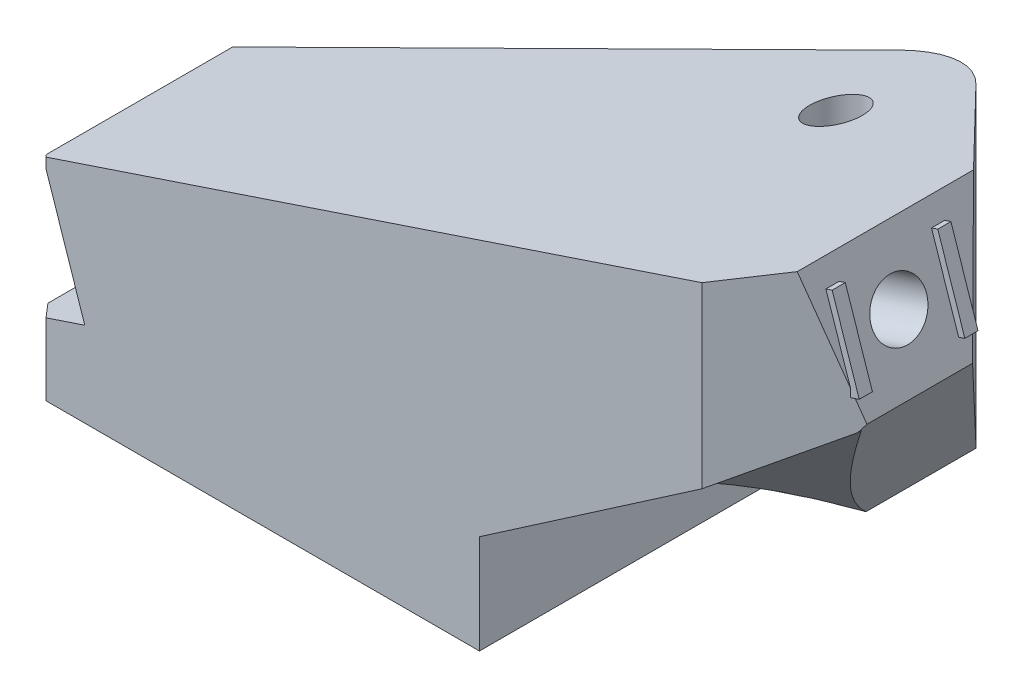
ISO-10303-21;
HEADER;
FILE_DESCRIPTION(('STEP AP214'),'2;1');
FILE_NAME('part.step','',(''),(''),'','','');
FILE_SCHEMA(('AUTOMOTIVE_DESIGN { 1 0 10303 214 1 1 1 1 }'));
ENDSEC;
DATA;
#1=APPLICATION_CONTEXT('core data for automotive mechanical design processes');
#2=APPLICATION_PROTOCOL_DEFINITION('international standard','automotive_design',2000,#1);
#3=PRODUCT_CONTEXT('',#1,'mechanical');
#4=PRODUCT('Part','Part','',(#3));
#5=PRODUCT_RELATED_PRODUCT_CATEGORY('part','',(#4));
#6=PRODUCT_DEFINITION_FORMATION('','',#4);
#7=PRODUCT_DEFINITION_CONTEXT('part definition',#1,'design');
#8=PRODUCT_DEFINITION('design','',#6,#7);
#9=PRODUCT_DEFINITION_SHAPE('','',#8);
#10=(LENGTH_UNIT() NAMED_UNIT(*) SI_UNIT(.MILLI.,.METRE.));
#11=(NAMED_UNIT(*) PLANE_ANGLE_UNIT() SI_UNIT($,.RADIAN.));
#12=(NAMED_UNIT(*) SI_UNIT($,.STERADIAN.) SOLID_ANGLE_UNIT());
#13=UNCERTAINTY_MEASURE_WITH_UNIT(LENGTH_MEASURE(1.E-05),#10,'distance_accuracy_value','');
#14=(GEOMETRIC_REPRESENTATION_CONTEXT(3) GLOBAL_UNCERTAINTY_ASSIGNED_CONTEXT((#13)) GLOBAL_UNIT_ASSIGNED_CONTEXT((#10,
#11,#12)) REPRESENTATION_CONTEXT('',''));
#15=CARTESIAN_POINT('',(0.,0.,0.));
#16=DIRECTION('',(0.,0.,1.));
#17=DIRECTION('',(1.,0.,0.));
#18=AXIS2_PLACEMENT_3D('',#15,#16,#17);
#19=CARTESIAN_POINT('',(-154.33875422493,28.9689270881601,-70.));
#20=DIRECTION('',(-0.316937711246489,0.948446354408006,0.));
#21=DIRECTION('',(-0.948446354408006,-0.316937711246489,0.));
#22=AXIS2_PLACEMENT_3D('',#19,#20,#21);
#23=PLANE('',#22);
#24=CARTESIAN_POINT('',(-64.6761161480805,58.9310553248555,-21.));
#25=DIRECTION('',(-0.316937711246489,0.948446354408006,0.));
#26=DIRECTION('',(-0.948446354408006,-0.316937711246489,0.));
#27=AXIS2_PLACEMENT_3D('',#24,#25,#26);
#28=ELLIPSE('',#27,4.21742355949767,4.00000000000001);
#29=CARTESIAN_POINT('',(-68.6761161480805,57.5943947545513,-21.));
#30=VERTEX_POINT('',#29);
#31=EDGE_CURVE('E276',#30,#30,#28,.T.);
#32=ORIENTED_EDGE('',*,*,#31,.F.);
#33=EDGE_LOOP('',(#32));
#34=FACE_BOUND('',#33,.T.);
#35=DIRECTION('',(0.907406140885003,0.303223502443224,-0.290980416953185));
#36=VECTOR('',#35,1.);
#37=CARTESIAN_POINT('',(-137.968434357253,34.439317360758,-13.2495153891155));
#38=LINE('',#37,#36);
#39=CARTESIAN_POINT('',(-145.802737035258,31.8213664893785,-10.7372680534737));
#40=VERTEX_POINT('',#39);
#41=CARTESIAN_POINT('',(-69.2564678070727,57.4004614596799,-35.2835702357627));
#42=VERTEX_POINT('',#41);
#43=EDGE_CURVE('E305',#40,#42,#38,.T.);
#44=ORIENTED_EDGE('',*,*,#43,.F.);
#45=DIRECTION('',(0.,0.,1.));
#46=VECTOR('',#45,1.);
#47=CARTESIAN_POINT('',(-145.802737035258,31.8213664893785,-70.));
#48=LINE('',#47,#46);
#49=CARTESIAN_POINT('',(-145.802737035258,31.8213664893785,17.48446354408));
#50=VERTEX_POINT('',#49);
#51=EDGE_CURVE('E62',#40,#50,#48,.T.);
#52=ORIENTED_EDGE('',*,*,#51,.T.);
#53=DIRECTION('',(-0.652851363434484,-0.218160168943055,-0.725390403816092));
#54=VECTOR('',#53,1.);
#55=CARTESIAN_POINT('',(-191.277379128913,16.6253262305573,-33.042916559981));
#56=LINE('',#55,#54);
#57=CARTESIAN_POINT('',(-145.33875422493,31.9764133713446,18.));
#58=VERTEX_POINT('',#57);
#59=EDGE_CURVE('E289',#58,#50,#56,.T.);
#60=ORIENTED_EDGE('',*,*,#59,.F.);
#61=DIRECTION('',(-0.948446354408006,-0.316937711246489,0.));
#62=VECTOR('',#61,1.);
#63=CARTESIAN_POINT('',(-154.33875422493,28.9689270881601,18.));
#64=LINE('',#63,#62);
#65=CARTESIAN_POINT('',(-45.9746916462233,65.1804195098939,18.));
#66=VERTEX_POINT('',#65);
#67=EDGE_CURVE('E307',#66,#58,#64,.T.);
#68=ORIENTED_EDGE('',*,*,#67,.F.);
#69=DIRECTION('',(-0.80164067190614,-0.267880369422278,0.534427114604093));
#70=VECTOR('',#69,1.);
#71=CARTESIAN_POINT('',(-85.6878116618454,51.9096790977336,44.4754133437481));
#72=LINE('',#71,#70);
#73=CARTESIAN_POINT('',(-37.3134458711531,68.0747059392065,12.2258361499532));
#74=VERTEX_POINT('',#73);
#75=EDGE_CURVE('E313',#74,#66,#72,.T.);
#76=ORIENTED_EDGE('',*,*,#75,.F.);
#77=DIRECTION('',(0.,0.,1.));
#78=VECTOR('',#77,1.);
#79=CARTESIAN_POINT('',(-37.3134458711531,68.0747059392065,-70.));
#80=LINE('',#79,#78);
#81=CARTESIAN_POINT('',(-37.3134458711531,68.0747059392065,-14.4795756185796));
#82=VERTEX_POINT('',#81);
#83=EDGE_CURVE('E243',#82,#74,#80,.T.);
#84=ORIENTED_EDGE('',*,*,#83,.F.);
#85=DIRECTION('',(0.680951260072626,0.227550174909512,0.696079233495838));
#86=VECTOR('',#85,1.);
#87=CARTESIAN_POINT('',(-123.953375448425,39.1226615192383,-103.044292811185));
#88=LINE('',#87,#86);
#89=CARTESIAN_POINT('',(-53.9536379806267,62.5141337704513,-31.4894452640965));
#90=VERTEX_POINT('',#89);
#91=EDGE_CURVE('E239',#90,#82,#88,.T.);
#92=ORIENTED_EDGE('',*,*,#91,.F.);
#93=CARTESIAN_POINT('',(-64.6761161480805,58.9310553248555,-21.));
#94=DIRECTION('',(-0.316937711246489,0.948446354408006,0.));
#95=DIRECTION('',(-0.948446354408006,-0.316937711246489,0.));
#96=AXIS2_PLACEMENT_3D('',#93,#94,#95);
#97=ELLIPSE('',#96,15.8153383481163,15.);
#98=EDGE_CURVE('E235',#42,#90,#97,.F.);
#99=ORIENTED_EDGE('',*,*,#98,.F.);
#100=EDGE_LOOP('',(#44,#52,#60,#68,#76,#84,#92,#99));
#101=FACE_BOUND('',#100,.T.);
#102=ADVANCED_FACE('F47',(#34,#101),#23,.T.);
#103=CARTESIAN_POINT('',(-154.33875422493,68.0747059392065,7.99999999999998));
#104=DIRECTION('',(0.743294146247166,0.,-0.66896473162245));
#105=DIRECTION('',(-0.66896473162245,0.,-0.743294146247166));
#106=AXIS2_PLACEMENT_3D('',#103,#104,#105);
#107=PLANE('',#106);
#108=DIRECTION('',(-0.298943071839602,0.894596813824064,-0.332158968710669));
#109=VECTOR('',#108,1.);
#110=CARTESIAN_POINT('',(-157.202708305041,65.9361493237048,4.81782879987588));
#111=LINE('',#110,#109);
#112=CARTESIAN_POINT('',(-145.33875422493,30.4328829187968,18.));
#113=VERTEX_POINT('',#112);
#114=EDGE_CURVE('E372',#113,#50,#111,.T.);
#115=ORIENTED_EDGE('',*,*,#114,.F.);
#116=DIRECTION('',(0.,-1.,0.));
#117=VECTOR('',#116,1.);
#118=CARTESIAN_POINT('',(-145.33875422493,68.0747059392065,18.));
#119=LINE('',#118,#117);
#120=EDGE_CURVE('E300',#58,#113,#119,.T.);
#121=ORIENTED_EDGE('',*,*,#120,.F.);
#122=ORIENTED_EDGE('',*,*,#59,.T.);
#123=EDGE_LOOP('',(#115,#121,#122));
#124=FACE_BOUND('',#123,.T.);
#125=ADVANCED_FACE('F484',(#124),#107,.F.);
#126=CARTESIAN_POINT('',(-159.877390731739,16.5745489314412,0.));
#127=DIRECTION('',(0.948446354408006,0.31693771124649,0.));
#128=DIRECTION('',(-0.31693771124649,0.948446354408006,0.));
#129=AXIS2_PLACEMENT_3D('',#126,#127,#128);
#130=CYLINDRICAL_SURFACE('',#129,4.2);
#131=CARTESIAN_POINT('',(-34.1440687586882,58.5902423951264,0.));
#132=DIRECTION('',(0.948446354408006,0.31693771124649,0.));
#133=DIRECTION('',(-0.31693771124649,0.948446354408006,0.));
#134=AXIS2_PLACEMENT_3D('',#131,#132,#133);
#135=CIRCLE('',#134,4.2);
#136=CARTESIAN_POINT('',(-35.4752071459235,62.5737170836401,0.));
#137=VERTEX_POINT('',#136);
#138=EDGE_CURVE('E279',#137,#137,#135,.T.);
#139=ORIENTED_EDGE('',*,*,#138,.T.);
#140=EDGE_LOOP('',(#139));
#141=FACE_BOUND('',#140,.T.);
#142=CARTESIAN_POINT('',(-142.633359922793,22.3369029452985,0.));
#143=DIRECTION('',(-0.948446354408006,-0.31693771124649,0.));
#144=DIRECTION('',(0.31693771124649,-0.948446354408006,0.));
#145=AXIS2_PLACEMENT_3D('',#142,#143,#144);
#146=CIRCLE('',#145,4.2);
#147=CARTESIAN_POINT('',(-141.302221535558,18.3534282567848,0.));
#148=VERTEX_POINT('',#147);
#149=EDGE_CURVE('E362',#148,#148,#146,.F.);
#150=ORIENTED_EDGE('',*,*,#149,.F.);
#151=EDGE_LOOP('',(#150));
#152=FACE_BOUND('',#151,.T.);
#153=ADVANCED_FACE('F491',(#141,#152),#130,.F.);
#154=CARTESIAN_POINT('',(-37.3134458711531,68.0747059392065,-70.));
#155=DIRECTION('',(0.948446354408006,0.31693771124649,0.));
#156=DIRECTION('',(-0.31693771124649,0.948446354408006,0.));
#157=AXIS2_PLACEMENT_3D('',#154,#155,#156);
#158=PLANE('',#157);
#159=ORIENTED_EDGE('',*,*,#138,.F.);
#160=EDGE_LOOP('',(#159));
#161=FACE_BOUND('',#160,.T.);
#162=DIRECTION('',(-0.31693771124649,0.948446354408006,0.));
#163=VECTOR('',#162,1.);
#164=CARTESIAN_POINT('',(-37.3134458711531,68.0747059392065,7.00499999999998));
#165=LINE('',#164,#163);
#166=CARTESIAN_POINT('',(-32.0980495760561,52.4674637987128,7.00499999999999));
#167=VERTEX_POINT('',#166);
#168=CARTESIAN_POINT('',(-36.2004238036371,64.7439513939065,7.005));
#169=VERTEX_POINT('',#168);
#170=EDGE_CURVE('E347',#167,#169,#165,.T.);
#171=ORIENTED_EDGE('',*,*,#170,.F.);
#172=DIRECTION('',(0.,0.,1.));
#173=VECTOR('',#172,1.);
#174=CARTESIAN_POINT('',(-32.0980495760561,52.4674637987128,-70.));
#175=LINE('',#174,#173);
#176=CARTESIAN_POINT('',(-32.0980495760561,52.4674637987128,8.74890528655511));
#177=VERTEX_POINT('',#176);
#178=EDGE_CURVE('E331',#167,#177,#175,.T.);
#179=ORIENTED_EDGE('',*,*,#178,.T.);
#180=DIRECTION('',(-0.310091393642938,0.927958527488735,0.206727595761958));
#181=VECTOR('',#180,1.);
#182=CARTESIAN_POINT('',(-32.0424040108691,52.3009426446569,8.71180824309711));
#183=LINE('',#182,#181);
#184=CARTESIAN_POINT('',(-30.9746916462234,49.1057788510464,7.99999999999998));
#185=VERTEX_POINT('',#184);
#186=EDGE_CURVE('E310',#185,#177,#183,.T.);
#187=ORIENTED_EDGE('',*,*,#186,.F.);
#188=DIRECTION('',(0.,0.,1.));
#189=VECTOR('',#188,1.);
#190=CARTESIAN_POINT('',(-30.9746916462234,49.1057788510464,-70.));
#191=LINE('',#190,#189);
#192=CARTESIAN_POINT('',(-30.9746916462234,49.1057788510464,-8.00000000000002));
#193=VERTEX_POINT('',#192);
#194=EDGE_CURVE('E237',#193,#185,#191,.T.);
#195=ORIENTED_EDGE('',*,*,#194,.F.);
#196=DIRECTION('',(0.301508942002732,-0.902275263297729,0.30820724704881));
#197=VECTOR('',#196,1.);
#198=CARTESIAN_POINT('',(-42.4728057266942,83.5142572214495,-19.7535555113419));
#199=LINE('',#198,#197);
#200=EDGE_CURVE('E315',#82,#193,#199,.T.);
#201=ORIENTED_EDGE('',*,*,#200,.F.);
#202=ORIENTED_EDGE('',*,*,#83,.T.);
#203=CARTESIAN_POINT('',(-32.4671916462234,53.5721333860959,8.99499999999999));
#204=VERTEX_POINT('',#203);
#205=EDGE_CURVE('E309',#204,#74,#183,.T.);
#206=ORIENTED_EDGE('',*,*,#205,.F.);
#207=DIRECTION('',(-0.31693771124649,0.948446354408006,0.));
#208=VECTOR('',#207,1.);
#209=CARTESIAN_POINT('',(-37.3134458711531,68.0747059392065,8.99499999999999));
#210=LINE('',#209,#208);
#211=CARTESIAN_POINT('',(-36.2004238036371,64.7439513939065,8.99499999999999));
#212=VERTEX_POINT('',#211);
#213=EDGE_CURVE('E418',#204,#212,#210,.T.);
#214=ORIENTED_EDGE('',*,*,#213,.T.);
#215=DIRECTION('',(0.,0.,-1.));
#216=VECTOR('',#215,1.);
#217=CARTESIAN_POINT('',(-36.2004238036371,64.7439513939065,-70.));
#218=LINE('',#217,#216);
#219=EDGE_CURVE('E344',#212,#169,#218,.T.);
#220=ORIENTED_EDGE('',*,*,#219,.T.);
#221=EDGE_LOOP('',(#171,#179,#187,#195,#201,#202,#206,#214,#220));
#222=FACE_BOUND('',#221,.T.);
#223=DIRECTION('',(0.,0.,1.));
#224=VECTOR('',#223,1.);
#225=CARTESIAN_POINT('',(-36.2004238036371,64.7439513939065,-70.));
#226=LINE('',#225,#224);
#227=CARTESIAN_POINT('',(-36.2004238036371,64.7439513939065,-8.99500000000001));
#228=VERTEX_POINT('',#227);
#229=CARTESIAN_POINT('',(-36.2004238036371,64.7439513939065,-7.00500000000001));
#230=VERTEX_POINT('',#229);
#231=EDGE_CURVE('E70',#228,#230,#226,.T.);
#232=ORIENTED_EDGE('',*,*,#231,.F.);
#233=DIRECTION('',(0.31693771124649,-0.948446354408006,0.));
#234=VECTOR('',#233,1.);
#235=CARTESIAN_POINT('',(-37.3134458711531,68.0747059392065,-8.99500000000001));
#236=LINE('',#235,#234);
#237=CARTESIAN_POINT('',(-32.0980495760561,52.4674637987128,-8.99500000000001));
#238=VERTEX_POINT('',#237);
#239=EDGE_CURVE('E55',#228,#238,#236,.T.);
#240=ORIENTED_EDGE('',*,*,#239,.T.);
#241=DIRECTION('',(0.,0.,-1.));
#242=VECTOR('',#241,1.);
#243=CARTESIAN_POINT('',(-32.0980495760561,52.4674637987128,-70.));
#244=LINE('',#243,#242);
#245=CARTESIAN_POINT('',(-32.0980495760561,52.4674637987128,-7.00500000000001));
#246=VERTEX_POINT('',#245);
#247=EDGE_CURVE('E355',#246,#238,#244,.T.);
#248=ORIENTED_EDGE('',*,*,#247,.F.);
#249=DIRECTION('',(0.31693771124649,-0.948446354408006,0.));
#250=VECTOR('',#249,1.);
#251=CARTESIAN_POINT('',(-37.3134458711531,68.0747059392065,-7.00500000000001));
#252=LINE('',#251,#250);
#253=EDGE_CURVE('E358',#230,#246,#252,.T.);
#254=ORIENTED_EDGE('',*,*,#253,.F.);
#255=EDGE_LOOP('',(#232,#240,#248,#254));
#256=FACE_BOUND('',#255,.T.);
#257=ADVANCED_FACE('F329',(#161,#222,#256),#158,.T.);
#258=CARTESIAN_POINT('',(-45.9746916462233,68.0747059392065,18.));
#259=DIRECTION('',(-0.554700196225229,0.,-0.832050294337844));
#260=DIRECTION('',(-0.832050294337844,0.,0.554700196225229));
#261=AXIS2_PLACEMENT_3D('',#258,#259,#260);
#262=PLANE('',#261);
#263=DIRECTION('',(0.80164067190614,0.267880369422279,-0.534427114604093));
#264=VECTOR('',#263,1.);
#265=CARTESIAN_POINT('',(-41.6273468311022,49.2831048228307,15.1017701232526));
#266=LINE('',#265,#264);
#267=CARTESIAN_POINT('',(-32.4671916462234,52.3441093862045,8.99499999999999));
#268=VERTEX_POINT('',#267);
#269=EDGE_CURVE('E335',#268,#177,#266,.T.);
#270=ORIENTED_EDGE('',*,*,#269,.F.);
#271=DIRECTION('',(0.,-1.,0.));
#272=VECTOR('',#271,1.);
#273=CARTESIAN_POINT('',(-32.4671916462234,68.0747059392065,8.99499999999999));
#274=LINE('',#273,#272);
#275=EDGE_CURVE('E345',#204,#268,#274,.T.);
#276=ORIENTED_EDGE('',*,*,#275,.F.);
#277=ORIENTED_EDGE('',*,*,#205,.T.);
#278=ORIENTED_EDGE('',*,*,#75,.T.);
#279=DIRECTION('',(0.,-1.,0.));
#280=VECTOR('',#279,1.);
#281=CARTESIAN_POINT('',(-45.9746916462233,68.0747059392065,18.));
#282=LINE('',#281,#280);
#283=CARTESIAN_POINT('',(-45.9746916462233,38.1381480709818,18.));
#284=VERTEX_POINT('',#283);
#285=EDGE_CURVE('E285',#66,#284,#282,.T.);
#286=ORIENTED_EDGE('',*,*,#285,.T.);
#287=DIRECTION('',(0.722476014829829,0.496025235014747,-0.48165067655322));
#288=VECTOR('',#287,1.);
#289=CARTESIAN_POINT('',(-35.2464371190208,45.5037697164382,10.8478303151983));
#290=LINE('',#289,#288);
#291=CARTESIAN_POINT('',(-31.8168553719061,47.8583933401934,8.56144248378848));
#292=VERTEX_POINT('',#291);
#293=EDGE_CURVE('E445',#284,#292,#290,.T.);
#294=ORIENTED_EDGE('',*,*,#293,.T.);
#295=DIRECTION('',(0.524264748754344,0.776523889006219,-0.349509832502896));
#296=VECTOR('',#295,1.);
#297=CARTESIAN_POINT('',(-29.2075233732608,51.7232510024923,6.82188781802494));
#298=LINE('',#297,#296);
#299=EDGE_CURVE('E274',#292,#185,#298,.T.);
#300=ORIENTED_EDGE('',*,*,#299,.T.);
#301=ORIENTED_EDGE('',*,*,#186,.T.);
#302=EDGE_LOOP('',(#270,#276,#277,#278,#286,#294,#300,#301));
#303=FACE_BOUND('',#302,.T.);
#304=ADVANCED_FACE('F334',(#303),#262,.F.);
#305=CARTESIAN_POINT('',(-64.6761161480805,68.0747059392065,-21.));
#306=DIRECTION('',(0.,-1.,0.));
#307=DIRECTION('',(1.,0.,0.));
#308=AXIS2_PLACEMENT_3D('',#305,#306,#307);
#309=CYLINDRICAL_SURFACE('',#308,4.00000000000001);
#310=ORIENTED_EDGE('',*,*,#31,.T.);
#311=EDGE_LOOP('',(#310));
#312=FACE_BOUND('',#311,.T.);
#313=CARTESIAN_POINT('',(-64.6761161480805,15.,-21.));
#314=DIRECTION('',(0.,-1.,0.));
#315=DIRECTION('',(0.,0.,-1.));
#316=AXIS2_PLACEMENT_3D('',#313,#314,#315);
#317=CIRCLE('',#316,4.00000000000001);
#318=CARTESIAN_POINT('',(-64.6761161480805,15.,-25.));
#319=VERTEX_POINT('',#318);
#320=EDGE_CURVE('E429',#319,#319,#317,.F.);
#321=ORIENTED_EDGE('',*,*,#320,.F.);
#322=EDGE_LOOP('',(#321));
#323=FACE_BOUND('',#322,.T.);
#324=ADVANCED_FACE('F511',(#312,#323),#309,.F.);
#325=CARTESIAN_POINT('',(-145.33875422493,68.0747059392065,18.));
#326=DIRECTION('',(0.,0.,-1.));
#327=DIRECTION('',(-1.,0.,0.));
#328=AXIS2_PLACEMENT_3D('',#325,#326,#327);
#329=PLANE('',#328);
#330=DIRECTION('',(-0.31693771124649,0.948446354408006,0.));
#331=VECTOR('',#330,1.);
#332=CARTESIAN_POINT('',(-156.653826630562,64.2936031555199,18.));
#333=LINE('',#332,#331);
#334=CARTESIAN_POINT('',(-139.463982810328,12.8524394012184,18.));
#335=VERTEX_POINT('',#334);
#336=EDGE_CURVE('E374',#335,#113,#333,.T.);
#337=ORIENTED_EDGE('',*,*,#336,.F.);
#338=DIRECTION('',(-0.948446354408006,-0.31693771124649,0.));
#339=VECTOR('',#338,1.);
#340=CARTESIAN_POINT('',(-128.148910404695,16.633542184905,18.));
#341=LINE('',#340,#339);
#342=CARTESIAN_POINT('',(-145.33875422493,10.8892955738562,18.));
#343=VERTEX_POINT('',#342);
#344=EDGE_CURVE('E378',#335,#343,#341,.T.);
#345=ORIENTED_EDGE('',*,*,#344,.T.);
#346=CARTESIAN_POINT('',(-145.33875422493,0.,18.));
#347=VERTEX_POINT('',#346);
#348=EDGE_CURVE('E297',#343,#347,#119,.T.);
#349=ORIENTED_EDGE('',*,*,#348,.T.);
#350=DIRECTION('',(1.,0.,0.));
#351=VECTOR('',#350,1.);
#352=CARTESIAN_POINT('',(-145.33875422493,0.,18.));
#353=LINE('',#352,#351);
#354=CARTESIAN_POINT('',(-79.6761161480805,0.,18.));
#355=VERTEX_POINT('',#354);
#356=EDGE_CURVE('E294',#347,#355,#353,.T.);
#357=ORIENTED_EDGE('',*,*,#356,.T.);
#358=DIRECTION('',(0.,-1.,0.));
#359=VECTOR('',#358,1.);
#360=CARTESIAN_POINT('',(-79.6761161480805,0.,18.));
#361=LINE('',#360,#359);
#362=CARTESIAN_POINT('',(-79.6761161480805,15.,18.));
#363=VERTEX_POINT('',#362);
#364=EDGE_CURVE('E264',#363,#355,#361,.T.);
#365=ORIENTED_EDGE('',*,*,#364,.F.);
#366=DIRECTION('',(0.8244024122231,0.566004118996261,0.));
#367=VECTOR('',#366,1.);
#368=CARTESIAN_POINT('',(-99.5375655162634,1.36386552859213,18.));
#369=LINE('',#368,#367);
#370=EDGE_CURVE('E522',#363,#284,#369,.T.);
#371=ORIENTED_EDGE('',*,*,#370,.T.);
#372=ORIENTED_EDGE('',*,*,#285,.F.);
#373=ORIENTED_EDGE('',*,*,#67,.T.);
#374=ORIENTED_EDGE('',*,*,#120,.T.);
#375=EDGE_LOOP('',(#337,#345,#349,#357,#365,#371,#372,#373,#374));
#376=FACE_BOUND('',#375,.T.);
#377=ADVANCED_FACE('F503',(#376),#329,.F.);
#378=CARTESIAN_POINT('',(-148.,0.,-70.));
#379=DIRECTION('',(0.,-1.,0.));
#380=DIRECTION('',(1.,0.,0.));
#381=AXIS2_PLACEMENT_3D('',#378,#379,#380);
#382=PLANE('',#381);
#383=DIRECTION('',(0.,0.,1.));
#384=VECTOR('',#383,1.);
#385=CARTESIAN_POINT('',(-79.6761161480805,0.,-36.));
#386=LINE('',#385,#384);
#387=CARTESIAN_POINT('',(-79.6761161480805,0.,-31.9422730126527));
#388=VERTEX_POINT('',#387);
#389=EDGE_CURVE('E254',#388,#355,#386,.T.);
#390=ORIENTED_EDGE('',*,*,#389,.T.);
#391=ORIENTED_EDGE('',*,*,#356,.F.);
#392=DIRECTION('',(0.66896473162245,0.,0.743294146247166));
#393=VECTOR('',#392,1.);
#394=CARTESIAN_POINT('',(-154.33875422493,0.,7.99999999999998));
#395=LINE('',#394,#393);
#396=CARTESIAN_POINT('',(-148.,0.,15.043060249922));
#397=VERTEX_POINT('',#396);
#398=EDGE_CURVE('E282',#397,#347,#395,.T.);
#399=ORIENTED_EDGE('',*,*,#398,.F.);
#400=DIRECTION('',(0.,0.,1.));
#401=VECTOR('',#400,1.);
#402=CARTESIAN_POINT('',(-148.,0.,-70.));
#403=LINE('',#402,#401);
#404=CARTESIAN_POINT('',(-148.,0.,-10.0326657096842));
#405=VERTEX_POINT('',#404);
#406=EDGE_CURVE('E234',#405,#397,#403,.T.);
#407=ORIENTED_EDGE('',*,*,#406,.F.);
#408=DIRECTION('',(-0.952238015717516,0.,0.305356777266148));
#409=VECTOR('',#408,1.);
#410=CARTESIAN_POINT('',(-154.33875422493,0.,-8.00000000000002));
#411=LINE('',#410,#409);
#412=EDGE_CURVE('E226',#388,#405,#411,.T.);
#413=ORIENTED_EDGE('',*,*,#412,.F.);
#414=EDGE_LOOP('',(#390,#391,#399,#407,#413));
#415=FACE_BOUND('',#414,.T.);
#416=ADVANCED_FACE('F501',(#415),#382,.T.);
#417=CARTESIAN_POINT('',(-148.,9.99999999999998,-70.));
#418=DIRECTION('',(-1.,0.,0.));
#419=DIRECTION('',(0.,0.,1.));
#420=AXIS2_PLACEMENT_3D('',#417,#418,#419);
#421=PLANE('',#420);
#422=DIRECTION('',(0.,1.,0.));
#423=VECTOR('',#422,1.);
#424=CARTESIAN_POINT('',(-148.,9.99999999999998,-10.0326657096843));
#425=LINE('',#424,#423);
#426=CARTESIAN_POINT('',(-148.,9.99999999999998,-10.0326657096842));
#427=VERTEX_POINT('',#426);
#428=EDGE_CURVE('E222',#405,#427,#425,.T.);
#429=ORIENTED_EDGE('',*,*,#428,.F.);
#430=ORIENTED_EDGE('',*,*,#406,.T.);
#431=DIRECTION('',(0.,-1.,0.));
#432=VECTOR('',#431,1.);
#433=CARTESIAN_POINT('',(-148.,9.99999999999998,15.043060249922));
#434=LINE('',#433,#432);
#435=CARTESIAN_POINT('',(-148.,9.99999999999998,15.043060249922));
#436=VERTEX_POINT('',#435);
#437=EDGE_CURVE('E231',#436,#397,#434,.T.);
#438=ORIENTED_EDGE('',*,*,#437,.F.);
#439=DIRECTION('',(0.,0.,1.));
#440=VECTOR('',#439,1.);
#441=CARTESIAN_POINT('',(-148.,9.99999999999998,-70.));
#442=LINE('',#441,#440);
#443=EDGE_CURVE('E216',#427,#436,#442,.T.);
#444=ORIENTED_EDGE('',*,*,#443,.F.);
#445=EDGE_LOOP('',(#429,#430,#438,#444));
#446=FACE_BOUND('',#445,.T.);
#447=ADVANCED_FACE('F49',(#446),#421,.T.);
#448=ORIENTED_EDGE('',*,*,#348,.F.);
#449=DIRECTION('',(-0.652851363434483,-0.218160168943056,-0.725390403816092));
#450=VECTOR('',#449,1.);
#451=CARTESIAN_POINT('',(-145.765710870786,10.7466215454199,17.5256037268263));
#452=LINE('',#451,#450);
#453=EDGE_CURVE('E376',#343,#436,#452,.T.);
#454=ORIENTED_EDGE('',*,*,#453,.T.);
#455=ORIENTED_EDGE('',*,*,#437,.T.);
#456=ORIENTED_EDGE('',*,*,#398,.T.);
#457=EDGE_LOOP('',(#448,#454,#455,#456));
#458=FACE_BOUND('',#457,.T.);
#459=ADVANCED_FACE('F494',(#458),#107,.F.);
#460=CARTESIAN_POINT('',(-154.33875422493,68.0747059392065,-8.00000000000002));
#461=DIRECTION('',(0.305356777266148,0.,0.952238015717516));
#462=DIRECTION('',(0.952238015717516,0.,-0.305356777266148));
#463=AXIS2_PLACEMENT_3D('',#460,#461,#462);
#464=PLANE('',#463);
#465=ORIENTED_EDGE('',*,*,#428,.T.);
#466=DIRECTION('',(0.907406140885003,0.303223502443224,-0.290980416953185));
#467=VECTOR('',#466,1.);
#468=CARTESIAN_POINT('',(-137.776867225545,13.4162146211497,-13.3109457468651));
#469=LINE('',#468,#467);
#470=CARTESIAN_POINT('',(-139.463982810328,12.8524394012184,-12.7699337631579));
#471=VERTEX_POINT('',#470);
#472=EDGE_CURVE('E12',#427,#471,#469,.T.);
#473=ORIENTED_EDGE('',*,*,#472,.T.);
#474=DIRECTION('',(0.315313407672332,-0.943585573413209,-0.101112415600296));
#475=VECTOR('',#474,1.);
#476=CARTESIAN_POINT('',(-157.524960882666,66.9005005876953,-6.97827036869848));
#477=LINE('',#476,#475);
#478=EDGE_CURVE('E364',#40,#471,#477,.T.);
#479=ORIENTED_EDGE('',*,*,#478,.F.);
#480=ORIENTED_EDGE('',*,*,#43,.T.);
#481=DIRECTION('',(0.,-1.,0.));
#482=VECTOR('',#481,1.);
#483=CARTESIAN_POINT('',(-69.2564678070727,68.0747059392065,-35.2835702357627));
#484=LINE('',#483,#482);
#485=CARTESIAN_POINT('',(-69.2564678070727,14.,-35.2835702357627));
#486=VERTEX_POINT('',#485);
#487=EDGE_CURVE('E286',#42,#486,#484,.T.);
#488=ORIENTED_EDGE('',*,*,#487,.T.);
#489=DIRECTION('',(-0.952238015717516,0.,0.305356777266148));
#490=VECTOR('',#489,1.);
#491=CARTESIAN_POINT('',(-154.33875422493,14.,-8.00000000000002));
#492=LINE('',#491,#490);
#493=CARTESIAN_POINT('',(-79.6761161480805,14.,-31.9422730126528));
#494=VERTEX_POINT('',#493);
#495=EDGE_CURVE('E268',#486,#494,#492,.T.);
#496=ORIENTED_EDGE('',*,*,#495,.T.);
#497=DIRECTION('',(0.,-1.,0.));
#498=VECTOR('',#497,1.);
#499=CARTESIAN_POINT('',(-79.6761161480805,68.0747059392065,-31.9422730126527));
#500=LINE('',#499,#498);
#501=EDGE_CURVE('E247',#494,#388,#500,.T.);
#502=ORIENTED_EDGE('',*,*,#501,.T.);
#503=ORIENTED_EDGE('',*,*,#412,.T.);
#504=EDGE_LOOP('',(#465,#473,#479,#480,#488,#496,#502,#503));
#505=FACE_BOUND('',#504,.T.);
#506=ADVANCED_FACE('F223',(#505),#464,.F.);
#507=CARTESIAN_POINT('',(-64.6761161480805,68.0747059392065,-21.));
#508=DIRECTION('',(0.,-1.,0.));
#509=DIRECTION('',(1.,0.,0.));
#510=AXIS2_PLACEMENT_3D('',#507,#508,#509);
#511=CYLINDRICAL_SURFACE('',#510,15.);
#512=CARTESIAN_POINT('',(-64.6761161480805,-0.811674652000632,-21.));
#513=DIRECTION('',(-0.828793671365151,0.559554331861594,0.));
#514=DIRECTION('',(-0.559554331861594,-0.828793671365151,0.));
#515=AXIS2_PLACEMENT_3D('',#512,#513,#514);
#516=ELLIPSE('',#515,26.8070482987705,15.);
#517=CARTESIAN_POINT('',(-53.9536379806267,15.0701111559499,-31.4894452640965));
#518=VERTEX_POINT('',#517);
#519=CARTESIAN_POINT('',(-54.6761161480805,14.,-32.1803398874989));
#520=VERTEX_POINT('',#519);
#521=EDGE_CURVE('E271',#518,#520,#516,.T.);
#522=ORIENTED_EDGE('',*,*,#521,.T.);
#523=CARTESIAN_POINT('',(-64.6761161480805,14.,-21.));
#524=DIRECTION('',(0.,1.,0.));
#525=DIRECTION('',(0.,0.,1.));
#526=AXIS2_PLACEMENT_3D('',#523,#524,#525);
#527=CIRCLE('',#526,15.);
#528=EDGE_CURVE('E265',#520,#486,#527,.T.);
#529=ORIENTED_EDGE('',*,*,#528,.T.);
#530=ORIENTED_EDGE('',*,*,#487,.F.);
#531=ORIENTED_EDGE('',*,*,#98,.T.);
#532=DIRECTION('',(0.,-1.,0.));
#533=VECTOR('',#532,1.);
#534=CARTESIAN_POINT('',(-53.9536379806267,68.0747059392065,-31.4894452640965));
#535=LINE('',#534,#533);
#536=EDGE_CURVE('E284',#90,#518,#535,.T.);
#537=ORIENTED_EDGE('',*,*,#536,.T.);
#538=EDGE_LOOP('',(#522,#529,#530,#531,#537));
#539=FACE_BOUND('',#538,.T.);
#540=ADVANCED_FACE('F530',(#539),#511,.T.);
#541=CARTESIAN_POINT('',(-30.9746916462234,68.0747059392065,-8.00000000000002));
#542=DIRECTION('',(-0.714831877830251,0.,0.699296350939769));
#543=DIRECTION('',(0.699296350939769,0.,0.714831877830251));
#544=AXIS2_PLACEMENT_3D('',#541,#542,#543);
#545=PLANE('',#544);
#546=ORIENTED_EDGE('',*,*,#200,.T.);
#547=DIRECTION('',(-0.485712671968853,-0.719421807155655,-0.496503236321547));
#548=VECTOR('',#547,1.);
#549=CARTESIAN_POINT('',(-24.346336048611,58.9234835100065,-1.22438924155636));
#550=LINE('',#549,#548);
#551=EDGE_CURVE('E230',#193,#518,#550,.T.);
#552=ORIENTED_EDGE('',*,*,#551,.T.);
#553=ORIENTED_EDGE('',*,*,#536,.F.);
#554=ORIENTED_EDGE('',*,*,#91,.T.);
#555=EDGE_LOOP('',(#546,#552,#553,#554));
#556=FACE_BOUND('',#555,.T.);
#557=ADVANCED_FACE('F469',(#556),#545,.F.);
#558=CARTESIAN_POINT('',(-79.6761161480805,0.,-36.));
#559=DIRECTION('',(-1.,0.,0.));
#560=DIRECTION('',(0.,0.,1.));
#561=AXIS2_PLACEMENT_3D('',#558,#559,#560);
#562=PLANE('',#561);
#563=DIRECTION('',(0.,0.,1.));
#564=VECTOR('',#563,1.);
#565=CARTESIAN_POINT('',(-79.6761161480805,14.,-36.));
#566=LINE('',#565,#564);
#567=CARTESIAN_POINT('',(-79.6761161480805,14.,-6.00000000000001));
#568=VERTEX_POINT('',#567);
#569=EDGE_CURVE('E250',#494,#568,#566,.T.);
#570=ORIENTED_EDGE('',*,*,#569,.T.);
#571=DIRECTION('',(0.,0.0712470499879097,0.997458699830735));
#572=VECTOR('',#571,1.);
#573=CARTESIAN_POINT('',(-79.6761161480805,14.,-6.));
#574=LINE('',#573,#572);
#575=CARTESIAN_POINT('',(-79.6761161480805,15.,8.));
#576=VERTEX_POINT('',#575);
#577=EDGE_CURVE('E436',#568,#576,#574,.T.);
#578=ORIENTED_EDGE('',*,*,#577,.T.);
#579=DIRECTION('',(0.,0.,1.));
#580=VECTOR('',#579,1.);
#581=CARTESIAN_POINT('',(-79.6761161480805,15.,8.));
#582=LINE('',#581,#580);
#583=EDGE_CURVE('E446',#576,#363,#582,.T.);
#584=ORIENTED_EDGE('',*,*,#583,.T.);
#585=ORIENTED_EDGE('',*,*,#364,.T.);
#586=ORIENTED_EDGE('',*,*,#389,.F.);
#587=ORIENTED_EDGE('',*,*,#501,.F.);
#588=EDGE_LOOP('',(#570,#578,#584,#585,#586,#587));
#589=FACE_BOUND('',#588,.T.);
#590=ADVANCED_FACE('F462',(#589),#562,.F.);
#591=CARTESIAN_POINT('',(-54.6761161480805,14.,-36.));
#592=DIRECTION('',(-0.828793671365151,0.559554331861594,0.));
#593=DIRECTION('',(-0.559554331861594,-0.828793671365151,0.));
#594=AXIS2_PLACEMENT_3D('',#591,#592,#593);
#595=PLANE('',#594);
#596=ORIENTED_EDGE('',*,*,#299,.F.);
#597=DIRECTION('',(0.,0.,-1.));
#598=VECTOR('',#597,1.);
#599=CARTESIAN_POINT('',(-31.8168553719061,47.8583933401935,-36.));
#600=LINE('',#599,#598);
#601=CARTESIAN_POINT('',(-31.8168553719061,47.8583933401934,7.99999999999998));
#602=VERTEX_POINT('',#601);
#603=EDGE_CURVE('E349',#292,#602,#600,.T.);
#604=ORIENTED_EDGE('',*,*,#603,.T.);
#605=CARTESIAN_POINT('',(-31.8168553719061,47.8583933401934,7.99999999999998));
#606=CARTESIAN_POINT('',(-32.4865124633809,46.8665190434605,7.4922521907665));
#607=CARTESIAN_POINT('',(-33.1544711629015,45.8771603496333,6.97727588303782));
#608=CARTESIAN_POINT('',(-34.4866946737837,43.90391422894,5.93092374422936));
#609=CARTESIAN_POINT('',(-35.1509577728481,42.9200293382728,5.3995409550043));
#610=CARTESIAN_POINT('',(-36.4750167592081,40.9588762456706,4.31878483523633));
#611=CARTESIAN_POINT('',(-37.1348119507182,39.9816090743103,3.76940877697818));
#612=CARTESIAN_POINT('',(-38.4508145996401,38.0323887666101,2.64931527452751));
#613=CARTESIAN_POINT('',(-39.1070083136933,37.0604559864857,2.07854617503087));
#614=CARTESIAN_POINT('',(-40.4131303068528,35.1258705846356,0.91489275914555));
#615=CARTESIAN_POINT('',(-41.0630593913917,34.1632167699294,0.322011334744143));
#616=CARTESIAN_POINT('',(-42.3556562295235,32.248664387668,-0.888305406927352));
#617=CARTESIAN_POINT('',(-42.9983247022468,31.2967647549605,-1.50573826462152));
#618=CARTESIAN_POINT('',(-44.1223643691761,29.6318737707105,-2.61674577442646));
#619=CARTESIAN_POINT('',(-44.6055124948784,28.9162504860479,-3.10457992720261));
#620=CARTESIAN_POINT('',(-45.5663181653779,27.4931363865242,-4.09724940638288));
#621=CARTESIAN_POINT('',(-46.0439757108244,26.7856455707016,-4.60208473077679));
#622=CARTESIAN_POINT('',(-46.9926310009448,25.3805282192853,-5.62953123306497));
#623=CARTESIAN_POINT('',(-47.4636348485765,24.6828926441891,-6.15212439063763));
#624=CARTESIAN_POINT('',(-48.398685650345,23.2979258183006,-7.21687405826604));
#625=CARTESIAN_POINT('',(-48.8627325162478,22.6105946981972,-7.75903081614587));
#626=CARTESIAN_POINT('',(-49.7873224897164,21.2411221108453,-8.86941305964635));
#627=CARTESIAN_POINT('',(-50.2477915168855,20.5590903690701,-9.43783587040377));
#628=CARTESIAN_POINT('',(-51.159737891475,19.208345069021,-10.5972204745933));
#629=CARTESIAN_POINT('',(-51.61121565057,18.5396309009881,-11.1881812324734));
#630=CARTESIAN_POINT('',(-52.5048855965519,17.2159560523726,-12.3949105682036));
#631=CARTESIAN_POINT('',(-52.9470608553578,16.5610204451129,-13.0107192694544));
#632=CARTESIAN_POINT('',(-53.820261377376,15.2676642413037,-14.2673408382287));
#633=CARTESIAN_POINT('',(-54.2512846992315,14.6292465202289,-14.9081580112302));
#634=CARTESIAN_POINT('',(-54.6761161480805,14.,-15.5619391536984));
#635=B_SPLINE_CURVE_WITH_KNOTS('',3,(#605,#606,#607,#608,#609,#610,#611,#612,#613,#614,#615,
#616,#617,#618,#619,#620,#621,#622,#623,#624,#625,#626,#627,#628,#629,#630,#631,#632,#633,#634),
.UNSPECIFIED.,.F.,.F.,(4,2,2,2,2,2,2,2,2,2,2,2,2,2,4),(0.,3.90009233848896,7.8018621002662,
11.7042261193884,15.6167112690945,19.5286865017935,23.4402708132043,26.4152938852044,
29.3903166054425,32.3624055521239,35.3345321613014,38.3346312328535,41.3345926244124,
44.3396089633656,47.3451449504779),.UNSPECIFIED.);
#636=CARTESIAN_POINT('',(-54.6761161480805,14.,-15.5619391536984));
#637=VERTEX_POINT('',#636);
#638=EDGE_CURVE('E437',#602,#637,#635,.T.);
#639=ORIENTED_EDGE('',*,*,#638,.T.);
#640=DIRECTION('',(0.,0.,1.));
#641=VECTOR('',#640,1.);
#642=CARTESIAN_POINT('',(-54.6761161480805,14.,-36.));
#643=LINE('',#642,#641);
#644=EDGE_CURVE('E255',#520,#637,#643,.T.);
#645=ORIENTED_EDGE('',*,*,#644,.F.);
#646=ORIENTED_EDGE('',*,*,#521,.F.);
#647=ORIENTED_EDGE('',*,*,#551,.F.);
#648=ORIENTED_EDGE('',*,*,#194,.T.);
#649=EDGE_LOOP('',(#596,#604,#639,#645,#646,#647,#648));
#650=FACE_BOUND('',#649,.T.);
#651=ADVANCED_FACE('F325',(#650),#595,.F.);
#652=CARTESIAN_POINT('',(-79.6761161480805,14.,-36.));
#653=DIRECTION('',(0.,1.,0.));
#654=DIRECTION('',(0.,0.,1.));
#655=AXIS2_PLACEMENT_3D('',#652,#653,#654);
#656=PLANE('',#655);
#657=CARTESIAN_POINT('',(-64.6761161480805,14.,-21.));
#658=DIRECTION('',(0.,-1.,0.));
#659=DIRECTION('',(0.,0.,-1.));
#660=AXIS2_PLACEMENT_3D('',#657,#658,#659);
#661=CIRCLE('',#660,7.);
#662=CARTESIAN_POINT('',(-64.6761161480805,14.,-28.));
#663=VERTEX_POINT('',#662);
#664=EDGE_CURVE('E425',#663,#663,#661,.T.);
#665=ORIENTED_EDGE('',*,*,#664,.F.);
#666=EDGE_LOOP('',(#665));
#667=FACE_BOUND('',#666,.T.);
#668=ORIENTED_EDGE('',*,*,#644,.T.);
#669=DIRECTION('',(-0.93401299959916,0.,0.35723901883722));
#670=VECTOR('',#669,1.);
#671=CARTESIAN_POINT('',(-69.6661395213401,14.,-9.82859149739339));
#672=LINE('',#671,#670);
#673=EDGE_CURVE('E249',#637,#568,#672,.T.);
#674=ORIENTED_EDGE('',*,*,#673,.T.);
#675=ORIENTED_EDGE('',*,*,#569,.F.);
#676=ORIENTED_EDGE('',*,*,#495,.F.);
#677=ORIENTED_EDGE('',*,*,#528,.F.);
#678=EDGE_LOOP('',(#668,#674,#675,#676,#677));
#679=FACE_BOUND('',#678,.T.);
#680=ADVANCED_FACE('F471',(#667,#679),#656,.F.);
#681=CARTESIAN_POINT('',(-32.5243207876442,47.3726738257692,0.));
#682=DIRECTION('',(-0.566004118996261,0.8244024122231,0.));
#683=DIRECTION('',(-0.8244024122231,-0.566004118996261,0.));
#684=AXIS2_PLACEMENT_3D('',#681,#682,#683);
#685=PLANE('',#684);
#686=ORIENTED_EDGE('',*,*,#583,.F.);
#687=DIRECTION('',(-0.8244024122231,-0.566004118996261,0.));
#688=VECTOR('',#687,1.);
#689=CARTESIAN_POINT('',(-30.,49.1057788510464,7.99999999999998));
#690=LINE('',#689,#688);
#691=EDGE_CURVE('E434',#602,#576,#690,.T.);
#692=ORIENTED_EDGE('',*,*,#691,.F.);
#693=ORIENTED_EDGE('',*,*,#603,.F.);
#694=ORIENTED_EDGE('',*,*,#293,.F.);
#695=ORIENTED_EDGE('',*,*,#370,.F.);
#696=EDGE_LOOP('',(#686,#692,#693,#694,#695));
#697=FACE_BOUND('',#696,.T.);
#698=ADVANCED_FACE('F459',(#697),#685,.F.);
#699=CARTESIAN_POINT('',(-30.,49.1057788510464,7.99999999999998));
#700=CARTESIAN_POINT('',(-79.6761161480805,15.,8.));
#701=CARTESIAN_POINT('',(-30.,43.2548157092054,2.49999999999999));
#702=CARTESIAN_POINT('',(-79.6761161480805,14.8333333333333,5.66666666666669));
#703=CARTESIAN_POINT('',(-30.,37.4038525673643,-3.));
#704=CARTESIAN_POINT('',(-79.6761161480805,14.6666666666667,3.33333333333336));
#705=CARTESIAN_POINT('',(-30.,25.7019262836822,-14.));
#706=CARTESIAN_POINT('',(-79.6761161480805,14.3333333333333,-1.3333333333333));
#707=CARTESIAN_POINT('',(-30.,19.8509631418411,-19.5));
#708=CARTESIAN_POINT('',(-79.6761161480805,14.1666666666667,-3.66666666666665));
#709=CARTESIAN_POINT('',(-30.,14.,-25.));
#710=CARTESIAN_POINT('',(-79.6761161480805,14.,-6.));
#711=B_SPLINE_SURFACE_WITH_KNOTS('',3,1,((#699,#700),(#701,#702),(#703,#704),(#705,#706),(#707,
#708),(#709,#710)),.UNSPECIFIED.,.F.,.F.,.F.,(4,2,4),(2,2),(0.,0.5,1.),(0.,1.),.UNSPECIFIED.);
#712=ORIENTED_EDGE('',*,*,#691,.T.);
#713=ORIENTED_EDGE('',*,*,#577,.F.);
#714=ORIENTED_EDGE('',*,*,#673,.F.);
#715=ORIENTED_EDGE('',*,*,#638,.F.);
#716=EDGE_LOOP('',(#712,#713,#714,#715));
#717=FACE_BOUND('',#716,.T.);
#718=ADVANCED_FACE('F451',(#717),#711,.F.);
#719=CARTESIAN_POINT('',(-64.6761161480805,15.,-21.));
#720=DIRECTION('',(0.,-1.,0.));
#721=DIRECTION('',(0.,0.,-1.));
#722=AXIS2_PLACEMENT_3D('',#719,#720,#721);
#723=PLANE('',#722);
#724=CARTESIAN_POINT('',(-64.6761161480805,15.,-21.));
#725=DIRECTION('',(0.,-1.,0.));
#726=DIRECTION('',(0.,0.,-1.));
#727=AXIS2_PLACEMENT_3D('',#724,#725,#726);
#728=CIRCLE('',#727,7.);
#729=CARTESIAN_POINT('',(-64.6761161480805,15.,-28.));
#730=VERTEX_POINT('',#729);
#731=EDGE_CURVE('E426',#730,#730,#728,.T.);
#732=ORIENTED_EDGE('',*,*,#731,.T.);
#733=EDGE_LOOP('',(#732));
#734=FACE_BOUND('',#733,.T.);
#735=ORIENTED_EDGE('',*,*,#320,.T.);
#736=EDGE_LOOP('',(#735));
#737=FACE_BOUND('',#736,.T.);
#738=ADVANCED_FACE('F458',(#734,#737),#723,.T.);
#739=CARTESIAN_POINT('',(-64.6761161480805,15.,-21.));
#740=DIRECTION('',(0.,-1.,0.));
#741=DIRECTION('',(0.,0.,-1.));
#742=AXIS2_PLACEMENT_3D('',#739,#740,#741);
#743=CYLINDRICAL_SURFACE('',#742,7.);
#744=ORIENTED_EDGE('',*,*,#731,.F.);
#745=EDGE_LOOP('',(#744));
#746=FACE_BOUND('',#745,.T.);
#747=ORIENTED_EDGE('',*,*,#664,.T.);
#748=EDGE_LOOP('',(#747));
#749=FACE_BOUND('',#748,.T.);
#750=ADVANCED_FACE('F627',(#746,#749),#743,.F.);
#751=CARTESIAN_POINT('',(-41.5825131201361,49.2980866862479,7.00499999999999));
#752=DIRECTION('',(0.,0.,-1.));
#753=DIRECTION('',(-1.,0.,0.));
#754=AXIS2_PLACEMENT_3D('',#751,#752,#753);
#755=PLANE('',#754);
#756=DIRECTION('',(0.948446354408006,0.31693771124649,0.));
#757=VECTOR('',#756,1.);
#758=CARTESIAN_POINT('',(-41.5825131201361,49.2980866862479,7.00499999999999));
#759=LINE('',#758,#757);
#760=CARTESIAN_POINT('',(-31.1496032216481,52.7844015099593,7.00499999999999));
#761=VERTEX_POINT('',#760);
#762=EDGE_CURVE('E416',#167,#761,#759,.T.);
#763=ORIENTED_EDGE('',*,*,#762,.F.);
#764=ORIENTED_EDGE('',*,*,#170,.T.);
#765=DIRECTION('',(0.948446354408006,0.31693771124649,0.));
#766=VECTOR('',#765,1.);
#767=CARTESIAN_POINT('',(-45.6848873477172,61.5745742814416,7.00499999999999));
#768=LINE('',#767,#766);
#769=CARTESIAN_POINT('',(-35.2519774492291,65.060889105153,7.00499999999999));
#770=VERTEX_POINT('',#769);
#771=EDGE_CURVE('E415',#169,#770,#768,.T.);
#772=ORIENTED_EDGE('',*,*,#771,.T.);
#773=DIRECTION('',(-0.31693771124649,0.948446354408006,0.));
#774=VECTOR('',#773,1.);
#775=CARTESIAN_POINT('',(-31.1496032216481,52.7844015099593,7.00499999999999));
#776=LINE('',#775,#774);
#777=EDGE_CURVE('E404',#761,#770,#776,.T.);
#778=ORIENTED_EDGE('',*,*,#777,.F.);
#779=EDGE_LOOP('',(#763,#764,#772,#778));
#780=FACE_BOUND('',#779,.T.);
#781=ADVANCED_FACE('F618',(#780),#755,.T.);
#782=CARTESIAN_POINT('',(-41.5825131201361,49.2980866862479,7.00499999999999));
#783=DIRECTION('',(-0.31693771124649,0.948446354408006,0.));
#784=DIRECTION('',(-0.948446354408006,-0.31693771124649,0.));
#785=AXIS2_PLACEMENT_3D('',#782,#783,#784);
#786=PLANE('',#785);
#787=ORIENTED_EDGE('',*,*,#178,.F.);
#788=ORIENTED_EDGE('',*,*,#762,.T.);
#789=DIRECTION('',(0.,0.,1.));
#790=VECTOR('',#789,1.);
#791=CARTESIAN_POINT('',(-31.1496032216481,52.7844015099593,7.00499999999999));
#792=LINE('',#791,#790);
#793=CARTESIAN_POINT('',(-31.1496032216481,52.7844015099593,8.99499999999999));
#794=VERTEX_POINT('',#793);
#795=EDGE_CURVE('E413',#761,#794,#792,.T.);
#796=ORIENTED_EDGE('',*,*,#795,.T.);
#797=DIRECTION('',(0.948446354408006,0.31693771124649,0.));
#798=VECTOR('',#797,1.);
#799=CARTESIAN_POINT('',(-41.5825131201361,49.2980866862479,8.99499999999999));
#800=LINE('',#799,#798);
#801=EDGE_CURVE('E343',#268,#794,#800,.T.);
#802=ORIENTED_EDGE('',*,*,#801,.F.);
#803=ORIENTED_EDGE('',*,*,#269,.T.);
#804=EDGE_LOOP('',(#787,#788,#796,#802,#803));
#805=FACE_BOUND('',#804,.T.);
#806=ADVANCED_FACE('F340',(#805),#786,.F.);
#807=CARTESIAN_POINT('',(-41.5825131201361,49.2980866862479,8.99499999999999));
#808=DIRECTION('',(0.,0.,-1.));
#809=DIRECTION('',(-1.,0.,0.));
#810=AXIS2_PLACEMENT_3D('',#807,#808,#809);
#811=PLANE('',#810);
#812=ORIENTED_EDGE('',*,*,#213,.F.);
#813=ORIENTED_EDGE('',*,*,#275,.T.);
#814=ORIENTED_EDGE('',*,*,#801,.T.);
#815=DIRECTION('',(-0.31693771124649,0.948446354408006,0.));
#816=VECTOR('',#815,1.);
#817=CARTESIAN_POINT('',(-31.1496032216481,52.7844015099593,8.99499999999999));
#818=LINE('',#817,#816);
#819=CARTESIAN_POINT('',(-35.2519774492291,65.060889105153,8.99499999999999));
#820=VERTEX_POINT('',#819);
#821=EDGE_CURVE('E410',#794,#820,#818,.T.);
#822=ORIENTED_EDGE('',*,*,#821,.T.);
#823=DIRECTION('',(0.948446354408006,0.31693771124649,0.));
#824=VECTOR('',#823,1.);
#825=CARTESIAN_POINT('',(-45.6848873477172,61.5745742814416,8.99499999999999));
#826=LINE('',#825,#824);
#827=EDGE_CURVE('E420',#212,#820,#826,.T.);
#828=ORIENTED_EDGE('',*,*,#827,.F.);
#829=EDGE_LOOP('',(#812,#813,#814,#822,#828));
#830=FACE_BOUND('',#829,.T.);
#831=ADVANCED_FACE('F617',(#830),#811,.F.);
#832=CARTESIAN_POINT('',(-45.6848873477172,61.5745742814416,8.99499999999999));
#833=DIRECTION('',(0.31693771124649,-0.948446354408006,0.));
#834=DIRECTION('',(0.948446354408006,0.31693771124649,0.));
#835=AXIS2_PLACEMENT_3D('',#832,#833,#834);
#836=PLANE('',#835);
#837=ORIENTED_EDGE('',*,*,#219,.F.);
#838=ORIENTED_EDGE('',*,*,#827,.T.);
#839=DIRECTION('',(0.,0.,-1.));
#840=VECTOR('',#839,1.);
#841=CARTESIAN_POINT('',(-35.2519774492291,65.060889105153,8.99499999999999));
#842=LINE('',#841,#840);
#843=EDGE_CURVE('E407',#820,#770,#842,.T.);
#844=ORIENTED_EDGE('',*,*,#843,.T.);
#845=ORIENTED_EDGE('',*,*,#771,.F.);
#846=EDGE_LOOP('',(#837,#838,#844,#845));
#847=FACE_BOUND('',#846,.T.);
#848=ADVANCED_FACE('F613',(#847),#836,.F.);
#849=CARTESIAN_POINT('',(-12.1537332278497,-4.06135399691571,0.));
#850=DIRECTION('',(-0.948446354408006,-0.31693771124649,0.));
#851=DIRECTION('',(0.,0.,1.));
#852=AXIS2_PLACEMENT_3D('',#849,#850,#851);
#853=PLANE('',#852);
#854=ORIENTED_EDGE('',*,*,#777,.T.);
#855=ORIENTED_EDGE('',*,*,#843,.F.);
#856=ORIENTED_EDGE('',*,*,#821,.F.);
#857=ORIENTED_EDGE('',*,*,#795,.F.);
#858=EDGE_LOOP('',(#854,#855,#856,#857));
#859=FACE_BOUND('',#858,.T.);
#860=ADVANCED_FACE('F609',(#859),#853,.F.);
#861=CARTESIAN_POINT('',(-31.1496032216481,52.7844015099593,-8.99500000000001));
#862=DIRECTION('',(0.,0.,1.));
#863=DIRECTION('',(1.,0.,0.));
#864=AXIS2_PLACEMENT_3D('',#861,#862,#863);
#865=PLANE('',#864);
#866=ORIENTED_EDGE('',*,*,#239,.F.);
#867=DIRECTION('',(-0.948446354408006,-0.31693771124649,0.));
#868=VECTOR('',#867,1.);
#869=CARTESIAN_POINT('',(-35.2519774492291,65.060889105153,-8.99500000000001));
#870=LINE('',#869,#868);
#871=CARTESIAN_POINT('',(-35.2519774492291,65.060889105153,-8.99500000000001));
#872=VERTEX_POINT('',#871);
#873=EDGE_CURVE('E401',#872,#228,#870,.T.);
#874=ORIENTED_EDGE('',*,*,#873,.F.);
#875=DIRECTION('',(-0.31693771124649,0.948446354408006,0.));
#876=VECTOR('',#875,1.);
#877=CARTESIAN_POINT('',(-31.1496032216481,52.7844015099593,-8.99500000000001));
#878=LINE('',#877,#876);
#879=CARTESIAN_POINT('',(-31.1496032216481,52.7844015099593,-8.99500000000001));
#880=VERTEX_POINT('',#879);
#881=EDGE_CURVE('E381',#880,#872,#878,.T.);
#882=ORIENTED_EDGE('',*,*,#881,.F.);
#883=DIRECTION('',(-0.948446354408006,-0.31693771124649,0.));
#884=VECTOR('',#883,1.);
#885=CARTESIAN_POINT('',(-31.1496032216481,52.7844015099593,-8.99500000000001));
#886=LINE('',#885,#884);
#887=EDGE_CURVE('E392',#880,#238,#886,.T.);
#888=ORIENTED_EDGE('',*,*,#887,.T.);
#889=EDGE_LOOP('',(#866,#874,#882,#888));
#890=FACE_BOUND('',#889,.T.);
#891=ADVANCED_FACE('F605',(#890),#865,.F.);
#892=CARTESIAN_POINT('',(-35.2519774492291,65.060889105153,-7.00500000000001));
#893=DIRECTION('',(-0.31693771124649,0.948446354408006,0.));
#894=DIRECTION('',(-0.948446354408006,-0.31693771124649,0.));
#895=AXIS2_PLACEMENT_3D('',#892,#893,#894);
#896=PLANE('',#895);
#897=ORIENTED_EDGE('',*,*,#873,.T.);
#898=ORIENTED_EDGE('',*,*,#231,.T.);
#899=DIRECTION('',(-0.948446354408006,-0.31693771124649,0.));
#900=VECTOR('',#899,1.);
#901=CARTESIAN_POINT('',(-35.2519774492291,65.060889105153,-7.00500000000001));
#902=LINE('',#901,#900);
#903=CARTESIAN_POINT('',(-35.2519774492291,65.060889105153,-7.00500000000001));
#904=VERTEX_POINT('',#903);
#905=EDGE_CURVE('E398',#904,#230,#902,.T.);
#906=ORIENTED_EDGE('',*,*,#905,.F.);
#907=DIRECTION('',(0.,0.,-1.));
#908=VECTOR('',#907,1.);
#909=CARTESIAN_POINT('',(-35.2519774492291,65.060889105153,-7.00500000000001));
#910=LINE('',#909,#908);
#911=EDGE_CURVE('E383',#904,#872,#910,.T.);
#912=ORIENTED_EDGE('',*,*,#911,.T.);
#913=EDGE_LOOP('',(#897,#898,#906,#912));
#914=FACE_BOUND('',#913,.T.);
#915=ADVANCED_FACE('F601',(#914),#896,.T.);
#916=CARTESIAN_POINT('',(-31.1496032216481,52.7844015099593,-7.00500000000001));
#917=DIRECTION('',(0.,0.,1.));
#918=DIRECTION('',(1.,0.,0.));
#919=AXIS2_PLACEMENT_3D('',#916,#917,#918);
#920=PLANE('',#919);
#921=ORIENTED_EDGE('',*,*,#905,.T.);
#922=ORIENTED_EDGE('',*,*,#253,.T.);
#923=DIRECTION('',(-0.948446354408006,-0.31693771124649,0.));
#924=VECTOR('',#923,1.);
#925=CARTESIAN_POINT('',(-31.1496032216481,52.7844015099593,-7.00500000000001));
#926=LINE('',#925,#924);
#927=CARTESIAN_POINT('',(-31.1496032216481,52.7844015099593,-7.00500000000001));
#928=VERTEX_POINT('',#927);
#929=EDGE_CURVE('E395',#928,#246,#926,.T.);
#930=ORIENTED_EDGE('',*,*,#929,.F.);
#931=DIRECTION('',(-0.31693771124649,0.948446354408006,0.));
#932=VECTOR('',#931,1.);
#933=CARTESIAN_POINT('',(-31.1496032216481,52.7844015099593,-7.00500000000001));
#934=LINE('',#933,#932);
#935=EDGE_CURVE('E386',#928,#904,#934,.T.);
#936=ORIENTED_EDGE('',*,*,#935,.T.);
#937=EDGE_LOOP('',(#921,#922,#930,#936));
#938=FACE_BOUND('',#937,.T.);
#939=ADVANCED_FACE('F597',(#938),#920,.T.);
#940=CARTESIAN_POINT('',(-31.1496032216481,52.7844015099593,-8.99500000000001));
#941=DIRECTION('',(0.31693771124649,-0.948446354408006,0.));
#942=DIRECTION('',(0.948446354408006,0.31693771124649,0.));
#943=AXIS2_PLACEMENT_3D('',#940,#941,#942);
#944=PLANE('',#943);
#945=ORIENTED_EDGE('',*,*,#929,.T.);
#946=ORIENTED_EDGE('',*,*,#247,.T.);
#947=ORIENTED_EDGE('',*,*,#887,.F.);
#948=DIRECTION('',(0.,0.,1.));
#949=VECTOR('',#948,1.);
#950=CARTESIAN_POINT('',(-31.1496032216481,52.7844015099593,-8.99500000000001));
#951=LINE('',#950,#949);
#952=EDGE_CURVE('E389',#880,#928,#951,.T.);
#953=ORIENTED_EDGE('',*,*,#952,.T.);
#954=EDGE_LOOP('',(#945,#946,#947,#953));
#955=FACE_BOUND('',#954,.T.);
#956=ADVANCED_FACE('F593',(#955),#944,.T.);
#957=CARTESIAN_POINT('',(-12.1537332278497,-4.06135399691571,0.));
#958=DIRECTION('',(-0.948446354408006,-0.31693771124649,0.));
#959=DIRECTION('',(0.,0.,1.));
#960=AXIS2_PLACEMENT_3D('',#957,#958,#959);
#961=PLANE('',#960);
#962=ORIENTED_EDGE('',*,*,#881,.T.);
#963=ORIENTED_EDGE('',*,*,#911,.F.);
#964=ORIENTED_EDGE('',*,*,#935,.F.);
#965=ORIENTED_EDGE('',*,*,#952,.F.);
#966=EDGE_LOOP('',(#962,#963,#964,#965));
#967=FACE_BOUND('',#966,.T.);
#968=ADVANCED_FACE('F588',(#967),#961,.F.);
#969=CARTESIAN_POINT('',(-139.463982810328,12.8524394012184,15.043060249922));
#970=DIRECTION('',(0.31693771124649,-0.948446354408006,0.));
#971=DIRECTION('',(0.948446354408006,0.31693771124649,0.));
#972=AXIS2_PLACEMENT_3D('',#969,#970,#971);
#973=PLANE('',#972);
#974=DIRECTION('',(0.,0.,1.));
#975=VECTOR('',#974,1.);
#976=CARTESIAN_POINT('',(-139.463982810328,12.8524394012184,-22.6888163717831));
#977=LINE('',#976,#975);
#978=EDGE_CURVE('E219',#471,#335,#977,.T.);
#979=ORIENTED_EDGE('',*,*,#978,.F.);
#980=ORIENTED_EDGE('',*,*,#472,.F.);
#981=ORIENTED_EDGE('',*,*,#443,.T.);
#982=ORIENTED_EDGE('',*,*,#453,.F.);
#983=ORIENTED_EDGE('',*,*,#344,.F.);
#984=EDGE_LOOP('',(#979,#980,#981,#982,#983));
#985=FACE_BOUND('',#984,.T.);
#986=ADVANCED_FACE('F214',(#985),#973,.F.);
#987=CARTESIAN_POINT('',(-121.591470746362,-40.6316311579902,0.));
#988=DIRECTION('',(-0.948446354408006,-0.31693771124649,0.));
#989=DIRECTION('',(0.31693771124649,-0.948446354408006,0.));
#990=AXIS2_PLACEMENT_3D('',#987,#988,#989);
#991=PLANE('',#990);
#992=ORIENTED_EDGE('',*,*,#149,.T.);
#993=EDGE_LOOP('',(#992));
#994=FACE_BOUND('',#993,.T.);
#995=ORIENTED_EDGE('',*,*,#336,.T.);
#996=ORIENTED_EDGE('',*,*,#114,.T.);
#997=ORIENTED_EDGE('',*,*,#51,.F.);
#998=ORIENTED_EDGE('',*,*,#478,.T.);
#999=ORIENTED_EDGE('',*,*,#978,.T.);
#1000=EDGE_LOOP('',(#995,#996,#997,#998,#999));
#1001=FACE_BOUND('',#1000,.T.);
#1002=ADVANCED_FACE('F582',(#994,#1001),#991,.T.);
#1003=CLOSED_SHELL('',(#102,#125,#153,#257,#304,#324,#377,#416,#447,#459,#506,#540,#557,#590,
#651,#680,#698,#718,#738,#750,#781,#806,#831,#848,#860,#891,#915,#939,#956,#968,#986,#1002));
#1004=MANIFOLD_SOLID_BREP('B2',#1003);
#1005=ADVANCED_BREP_SHAPE_REPRESENTATION('',(#18,#1004),#14);
#1006=SHAPE_DEFINITION_REPRESENTATION(#9,#1005);
ENDSEC;
END-ISO-10303-21;
